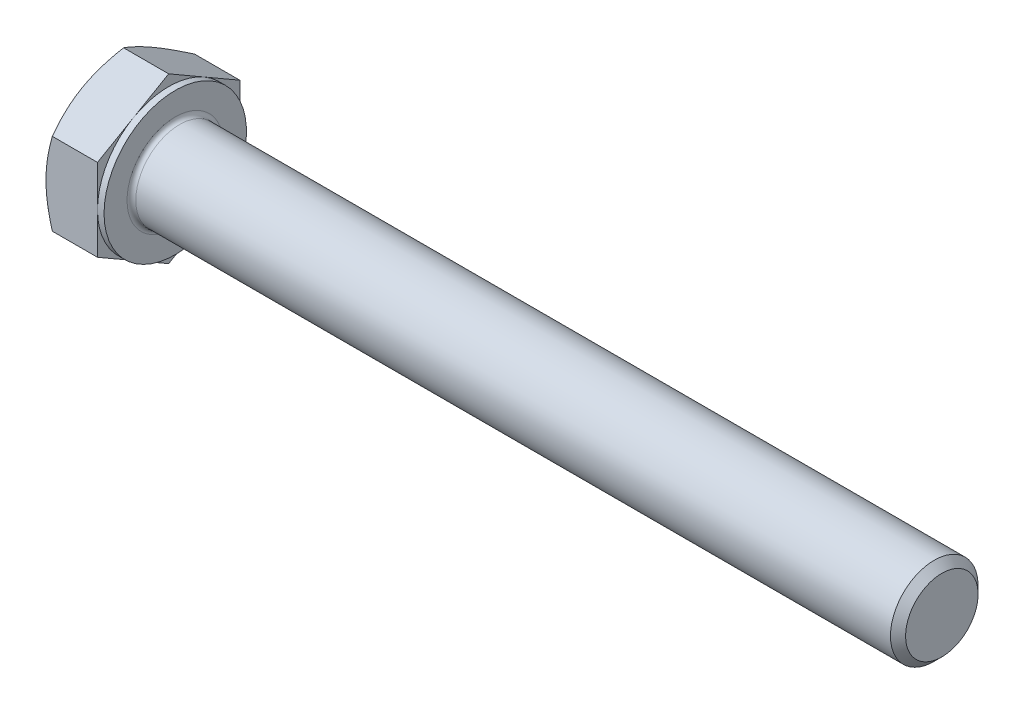
ISO-10303-21;
HEADER;
FILE_DESCRIPTION(('STEP AP214'),'2;1');
FILE_NAME('part.step','',(''),(''),'','','');
FILE_SCHEMA(('AUTOMOTIVE_DESIGN { 1 0 10303 214 1 1 1 1 }'));
ENDSEC;
DATA;
#1=APPLICATION_CONTEXT('core data for automotive mechanical design processes');
#2=APPLICATION_PROTOCOL_DEFINITION('international standard','automotive_design',2000,#1);
#3=PRODUCT_CONTEXT('',#1,'mechanical');
#4=PRODUCT('Part','Part','',(#3));
#5=PRODUCT_RELATED_PRODUCT_CATEGORY('part','',(#4));
#6=PRODUCT_DEFINITION_FORMATION('','',#4);
#7=PRODUCT_DEFINITION_CONTEXT('part definition',#1,'design');
#8=PRODUCT_DEFINITION('design','',#6,#7);
#9=PRODUCT_DEFINITION_SHAPE('','',#8);
#10=(LENGTH_UNIT() NAMED_UNIT(*) SI_UNIT(.MILLI.,.METRE.));
#11=(NAMED_UNIT(*) PLANE_ANGLE_UNIT() SI_UNIT($,.RADIAN.));
#12=(NAMED_UNIT(*) SI_UNIT($,.STERADIAN.) SOLID_ANGLE_UNIT());
#13=UNCERTAINTY_MEASURE_WITH_UNIT(LENGTH_MEASURE(1.E-05),#10,'distance_accuracy_value','');
#14=(GEOMETRIC_REPRESENTATION_CONTEXT(3) GLOBAL_UNCERTAINTY_ASSIGNED_CONTEXT((#13)) GLOBAL_UNIT_ASSIGNED_CONTEXT((#10,
#11,#12)) REPRESENTATION_CONTEXT('',''));
#15=CARTESIAN_POINT('',(0.,0.,0.));
#16=DIRECTION('',(0.,0.,1.));
#17=DIRECTION('',(1.,0.,0.));
#18=AXIS2_PLACEMENT_3D('',#15,#16,#17);
#19=CARTESIAN_POINT('',(0.,7.50555349946514,0.));
#20=DIRECTION('',(1.,0.,0.));
#21=DIRECTION('',(0.,0.,-1.));
#22=AXIS2_PLACEMENT_3D('',#19,#20,#21);
#23=PLANE('',#22);
#24=CARTESIAN_POINT('',(0.,0.,0.));
#25=DIRECTION('',(1.,0.,0.));
#26=DIRECTION('',(0.,0.,-1.));
#27=AXIS2_PLACEMENT_3D('',#24,#25,#26);
#28=CIRCLE('',#27,6.49999999995998);
#29=CARTESIAN_POINT('',(1.1554717790737E-11,-5.62916512458153,-3.24999999999));
#30=VERTEX_POINT('',#29);
#31=CARTESIAN_POINT('',(1.15520782680806E-11,0.,-6.49999999997999));
#32=VERTEX_POINT('',#31);
#33=EDGE_CURVE('E114',#30,#32,#28,.T.);
#34=ORIENTED_EDGE('',*,*,#33,.F.);
#35=CARTESIAN_POINT('',(0.,0.,0.));
#36=DIRECTION('',(1.,0.,0.));
#37=DIRECTION('',(0.,0.,-1.));
#38=AXIS2_PLACEMENT_3D('',#35,#36,#37);
#39=CIRCLE('',#38,6.49999999995998);
#40=CARTESIAN_POINT('',(1.15530521350374E-11,-5.62916512458151,3.24999999999001));
#41=VERTEX_POINT('',#40);
#42=EDGE_CURVE('E111',#41,#30,#39,.T.);
#43=ORIENTED_EDGE('',*,*,#42,.F.);
#44=CARTESIAN_POINT('',(0.,0.,0.));
#45=DIRECTION('',(1.,0.,0.));
#46=DIRECTION('',(0.,0.,-1.));
#47=AXIS2_PLACEMENT_3D('',#44,#45,#46);
#48=CIRCLE('',#47,6.49999999995998);
#49=CARTESIAN_POINT('',(1.15519427428088E-11,0.,6.49999999997999));
#50=VERTEX_POINT('',#49);
#51=EDGE_CURVE('E474',#50,#41,#48,.T.);
#52=ORIENTED_EDGE('',*,*,#51,.F.);
#53=CARTESIAN_POINT('',(0.,0.,0.));
#54=DIRECTION('',(1.,0.,0.));
#55=DIRECTION('',(0.,0.,-1.));
#56=AXIS2_PLACEMENT_3D('',#53,#54,#55);
#57=CIRCLE('',#56,6.49999999995998);
#58=CARTESIAN_POINT('',(1.15519072203646E-11,5.62916512458152,3.24999999999));
#59=VERTEX_POINT('',#58);
#60=EDGE_CURVE('E176',#59,#50,#57,.T.);
#61=ORIENTED_EDGE('',*,*,#60,.F.);
#62=CARTESIAN_POINT('',(0.,0.,0.));
#63=DIRECTION('',(1.,0.,0.));
#64=DIRECTION('',(0.,0.,-1.));
#65=AXIS2_PLACEMENT_3D('',#62,#63,#64);
#66=CIRCLE('',#65,6.49999999995998);
#67=CARTESIAN_POINT('',(1.15517194402141E-11,5.62916512458152,-3.24999999999));
#68=VERTEX_POINT('',#67);
#69=EDGE_CURVE('E472',#68,#59,#66,.T.);
#70=ORIENTED_EDGE('',*,*,#69,.F.);
#71=CARTESIAN_POINT('',(0.,0.,0.));
#72=DIRECTION('',(1.,0.,0.));
#73=DIRECTION('',(0.,0.,-1.));
#74=AXIS2_PLACEMENT_3D('',#71,#72,#73);
#75=CIRCLE('',#74,6.49999999995998);
#76=EDGE_CURVE('E117',#32,#68,#75,.T.);
#77=ORIENTED_EDGE('',*,*,#76,.F.);
#78=EDGE_LOOP('',(#34,#43,#52,#61,#70,#77));
#79=FACE_BOUND('',#78,.T.);
#80=ADVANCED_FACE('F17',(#79),#23,.F.);
#81=CARTESIAN_POINT('',(0.584039923126056,0.,0.));
#82=DIRECTION('',(1.,0.,0.));
#83=DIRECTION('',(0.,0.,-1.));
#84=AXIS2_PLACEMENT_3D('',#81,#82,#83);
#85=CONICAL_SURFACE('',#84,7.51158682049891,1.047197551212);
#86=ORIENTED_EDGE('',*,*,#42,.T.);
#87=CARTESIAN_POINT('',(2.38330535814892E-11,-5.62916512459777,-3.24999999999938));
#88=CARTESIAN_POINT('',(-2.65652344164261E-05,-5.70880728473447,-3.11205573221969));
#89=CARTESIAN_POINT('',(0.00337972763251715,-5.78844560823788,-2.97411810968284));
#90=CARTESIAN_POINT('',(0.0168605830573989,-5.94756588426562,-2.69851370708889));
#91=CARTESIAN_POINT('',(0.0269338255085056,-6.02704786462283,-2.56084687882384));
#92=CARTESIAN_POINT('',(0.0534848017009937,-6.18534206384372,-2.28667328322969));
#93=CARTESIAN_POINT('',(0.0699302938009773,-6.26415564509097,-2.15016415618305));
#94=CARTESIAN_POINT('',(0.108872020464248,-6.42140731241996,-1.87779627879436));
#95=CARTESIAN_POINT('',(0.131368414291867,-6.4998453885628,-1.74193754566698));
#96=CARTESIAN_POINT('',(0.207238975555897,-6.73427122699288,-1.33590008289914));
#97=CARTESIAN_POINT('',(0.269031363386546,-6.88957797343577,-1.06690090730184));
#98=CARTESIAN_POINT('',(0.4115404146045,-7.19885589650209,-0.531215830891611));
#99=CARTESIAN_POINT('',(0.49235158909237,-7.35281628523265,-0.264548615257222));
#100=CARTESIAN_POINT('',(0.580556583603043,-7.50555349946482,-5.67872870583599E-13));
#101=B_SPLINE_CURVE_WITH_KNOTS('',3,(#87,#88,#89,#90,#91,#92,#93,#94,#95,#96,#97,#98,#99,#100),
.UNSPECIFIED.,.F.,.F.,(4,2,2,2,2,2,4),(0.,0.47780419504982,0.955513809519797,1.43083727329602,
1.90617324917161,2.85559935540238,3.80984701130895),.UNSPECIFIED.);
#102=CARTESIAN_POINT('',(0.580556583603043,-7.50555349946482,0.));
#103=VERTEX_POINT('',#102);
#104=EDGE_CURVE('E129',#30,#103,#101,.T.);
#105=ORIENTED_EDGE('',*,*,#104,.T.);
#106=CARTESIAN_POINT('',(0.580556583603042,-7.50555349946482,5.69563900151584E-13));
#107=CARTESIAN_POINT('',(0.492351589092377,-7.35281628523265,0.264548615257212));
#108=CARTESIAN_POINT('',(0.411540414604506,-7.19885589650209,0.531215830891593));
#109=CARTESIAN_POINT('',(0.269031363386549,-6.88957797343579,1.06690090730181));
#110=CARTESIAN_POINT('',(0.207238975555897,-6.7342712269929,1.33590008289911));
#111=CARTESIAN_POINT('',(0.131368414291873,-6.49984538856282,1.74193754566694));
#112=CARTESIAN_POINT('',(0.108872020464258,-6.42140731241997,1.87779627879431));
#113=CARTESIAN_POINT('',(0.0699302938009776,-6.26415564509101,2.15016415618299));
#114=CARTESIAN_POINT('',(0.0534848017009802,-6.18534206384378,2.28667328322964));
#115=CARTESIAN_POINT('',(0.0269338255085282,-6.02704786462284,2.56084687882374));
#116=CARTESIAN_POINT('',(0.0168605830574716,-5.94756588426557,2.69851370708873));
#117=CARTESIAN_POINT('',(0.00337972763244808,-5.78844560823805,2.97411810968277));
#118=CARTESIAN_POINT('',(-2.65652346774801E-05,-5.70880728473494,3.11205573221977));
#119=CARTESIAN_POINT('',(2.31061042700748E-11,-5.62916512459895,3.24999999999984));
#120=B_SPLINE_CURVE_WITH_KNOTS('',3,(#106,#107,#108,#109,#110,#111,#112,#113,#114,#115,#116,
#117,#118,#119),.UNSPECIFIED.,.F.,.F.,(4,2,2,2,2,2,4),(0.,0.95424765590654,1.9036737621373,
2.37900973801287,2.85433320178907,3.33204281625901,3.80984701130877),.UNSPECIFIED.);
#121=EDGE_CURVE('E135',#103,#41,#120,.T.);
#122=ORIENTED_EDGE('',*,*,#121,.T.);
#123=EDGE_LOOP('',(#86,#105,#122));
#124=FACE_BOUND('',#123,.T.);
#125=ADVANCED_FACE('F133',(#124),#85,.T.);
#126=CARTESIAN_POINT('',(0.584039923126056,0.,0.));
#127=DIRECTION('',(1.,0.,0.));
#128=DIRECTION('',(0.,0.,-1.));
#129=AXIS2_PLACEMENT_3D('',#126,#127,#128);
#130=CONICAL_SURFACE('',#129,7.51158682049891,1.047197551212);
#131=ORIENTED_EDGE('',*,*,#33,.T.);
#132=CARTESIAN_POINT('',(2.38261934329666E-11,0.,-6.49999999999875));
#133=CARTESIAN_POINT('',(-2.65652344229879E-05,-0.159284320272008,-6.49999999999955));
#134=CARTESIAN_POINT('',(0.00337972763251106,-0.318560967278251,-6.49999999999988));
#135=CARTESIAN_POINT('',(0.0168605830573936,-0.636801519333315,-6.50000000000012));
#136=CARTESIAN_POINT('',(0.0269338255085006,-0.795765480047881,-6.50000000000003));
#137=CARTESIAN_POINT('',(0.0534848017009886,-1.11235387848978,-6.49999999999997));
#138=CARTESIAN_POINT('',(0.0699302938009718,-1.26998104098423,-6.49999999999999));
#139=CARTESIAN_POINT('',(0.108872020464242,-1.58448437564218,-6.50000000000001));
#140=CARTESIAN_POINT('',(0.131368414291862,-1.74136052792788,-6.5));
#141=CARTESIAN_POINT('',(0.207238975555892,-2.21021220478805,-6.49999999999999));
#142=CARTESIAN_POINT('',(0.269031363386541,-2.52082569767383,-6.5));
#143=CARTESIAN_POINT('',(0.411540414604495,-3.13938154380645,-6.5));
#144=CARTESIAN_POINT('',(0.492351589092366,-3.44730232126758,-6.50000000000001));
#145=CARTESIAN_POINT('',(0.580556583603039,-3.75277674973192,-6.5));
#146=B_SPLINE_CURVE_WITH_KNOTS('',3,(#132,#133,#134,#135,#136,#137,#138,#139,#140,#141,#142,
#143,#144,#145),.UNSPECIFIED.,.F.,.F.,(4,2,2,2,2,2,4),(0.,0.477804195049821,0.955513809519796,
1.43083727329602,1.90617324917161,2.85559935540238,3.80984701130895),.UNSPECIFIED.);
#147=CARTESIAN_POINT('',(0.580556583603039,-3.75277674973241,-6.49999999999972));
#148=VERTEX_POINT('',#147);
#149=EDGE_CURVE('E125',#32,#148,#146,.T.);
#150=ORIENTED_EDGE('',*,*,#149,.T.);
#151=CARTESIAN_POINT('',(0.580556583603039,-3.7527767497329,-6.49999999999943));
#152=CARTESIAN_POINT('',(0.492351589092374,-3.90551396396507,-6.23545138474279));
#153=CARTESIAN_POINT('',(0.411540414604505,-4.05947435269563,-5.96878416910841));
#154=CARTESIAN_POINT('',(0.26903136338655,-4.36875227576193,-5.4330990926982));
#155=CARTESIAN_POINT('',(0.207238975555899,-4.52405902220482,-5.1640999171009));
#156=CARTESIAN_POINT('',(0.131368414291876,-4.7584848606349,-4.75806245433307));
#157=CARTESIAN_POINT('',(0.108872020464261,-4.83692293677774,-4.62220372120571));
#158=CARTESIAN_POINT('',(0.0699302938009808,-4.9941746041067,-4.34983584381702));
#159=CARTESIAN_POINT('',(0.0534848017009837,-5.07298818535393,-4.21332671677038));
#160=CARTESIAN_POINT('',(0.0269338255085323,-5.23128238457486,-3.93915312117628));
#161=CARTESIAN_POINT('',(0.016860583057476,-5.31076436493214,-3.80148629291129));
#162=CARTESIAN_POINT('',(0.00337972763245258,-5.46988464095965,-3.52588189031725));
#163=CARTESIAN_POINT('',(-2.65652346731176E-05,-5.54952296446276,-3.38794426778026));
#164=CARTESIAN_POINT('',(2.31099363530069E-11,-5.62916512459875,-3.25000000000019));
#165=B_SPLINE_CURVE_WITH_KNOTS('',3,(#151,#152,#153,#154,#155,#156,#157,#158,#159,#160,#161,
#162,#163,#164),.UNSPECIFIED.,.F.,.F.,(4,2,2,2,2,2,4),(0.,0.954247655906531,1.90367376213729,
2.37900973801285,2.85433320178905,3.33204281625898,3.80984701130874),.UNSPECIFIED.);
#166=EDGE_CURVE('E123',#148,#30,#165,.T.);
#167=ORIENTED_EDGE('',*,*,#166,.T.);
#168=EDGE_LOOP('',(#131,#150,#167));
#169=FACE_BOUND('',#168,.T.);
#170=ADVANCED_FACE('F124',(#169),#130,.T.);
#171=CARTESIAN_POINT('',(0.584039923126056,0.,0.));
#172=DIRECTION('',(1.,0.,0.));
#173=DIRECTION('',(0.,0.,-1.));
#174=AXIS2_PLACEMENT_3D('',#171,#172,#173);
#175=CONICAL_SURFACE('',#174,7.51158682049891,1.047197551212);
#176=CARTESIAN_POINT('',(0.580556583603033,3.7527767497319,-6.5));
#177=CARTESIAN_POINT('',(0.492351589092368,3.44730232126758,-6.5));
#178=CARTESIAN_POINT('',(0.411540414604499,3.13938154380646,-6.5));
#179=CARTESIAN_POINT('',(0.269031363386544,2.52082569767386,-6.5));
#180=CARTESIAN_POINT('',(0.207238975555893,2.21021220478808,-6.5));
#181=CARTESIAN_POINT('',(0.13136841429187,1.74136052792792,-6.5));
#182=CARTESIAN_POINT('',(0.108872020464255,1.58448437564224,-6.5));
#183=CARTESIAN_POINT('',(0.0699302938009747,1.26998104098431,-6.5));
#184=CARTESIAN_POINT('',(0.0534848017009776,1.11235387848986,-6.5));
#185=CARTESIAN_POINT('',(0.0269338255085264,0.795765480047986,-6.5));
#186=CARTESIAN_POINT('',(0.0168605830574702,0.636801519333434,-6.5));
#187=CARTESIAN_POINT('',(0.00337972763244701,0.318560967278407,-6.5));
#188=CARTESIAN_POINT('',(-2.65652346786734E-05,0.159284320272187,-6.5));
#189=CARTESIAN_POINT('',(2.31041565361612E-11,2.07888749653668E-13,-6.5));
#190=B_SPLINE_CURVE_WITH_KNOTS('',3,(#176,#177,#178,#179,#180,#181,#182,#183,#184,#185,#186,
#187,#188,#189),.UNSPECIFIED.,.F.,.F.,(4,2,2,2,2,2,4),(0.,0.954247655906532,1.90367376213729,
2.37900973801285,2.85433320178905,3.33204281625898,3.80984701130874),.UNSPECIFIED.);
#191=CARTESIAN_POINT('',(0.580556583603033,3.7527767497324,-6.49999999999971));
#192=VERTEX_POINT('',#191);
#193=EDGE_CURVE('E143',#192,#32,#190,.T.);
#194=ORIENTED_EDGE('',*,*,#193,.T.);
#195=ORIENTED_EDGE('',*,*,#76,.T.);
#196=CARTESIAN_POINT('',(2.38258913852585E-11,5.62916512459776,-3.24999999999938));
#197=CARTESIAN_POINT('',(-2.65652344229074E-05,5.54952296446245,-3.38794426777988));
#198=CARTESIAN_POINT('',(0.00337972763251109,5.46988464095962,-3.52588189031705));
#199=CARTESIAN_POINT('',(0.0168605830573933,5.31076436493229,-3.80148629291124));
#200=CARTESIAN_POINT('',(0.0269338255084999,5.23128238457493,-3.9391531211762));
#201=CARTESIAN_POINT('',(0.0534848017009876,5.07298818535393,-4.21332671677028));
#202=CARTESIAN_POINT('',(0.0699302938009709,4.99417460410672,-4.34983584381695));
#203=CARTESIAN_POINT('',(0.108872020464241,4.83692293677777,-4.62220372120566));
#204=CARTESIAN_POINT('',(0.13136841429186,4.75848486063491,-4.75806245433303));
#205=CARTESIAN_POINT('',(0.207238975555889,4.52405902220482,-5.16409991710086));
#206=CARTESIAN_POINT('',(0.269031363386538,4.36875227576193,-5.43309909269816));
#207=CARTESIAN_POINT('',(0.411540414604492,4.05947435269562,-5.96878416910839));
#208=CARTESIAN_POINT('',(0.492351589092362,3.90551396396506,-6.23545138474278));
#209=CARTESIAN_POINT('',(0.580556583603033,3.75277674973289,-6.49999999999943));
#210=B_SPLINE_CURVE_WITH_KNOTS('',3,(#196,#197,#198,#199,#200,#201,#202,#203,#204,#205,#206,
#207,#208,#209),.UNSPECIFIED.,.F.,.F.,(4,2,2,2,2,2,4),(0.,0.477804195049819,0.955513809519792,
1.43083727329602,1.90617324917161,2.85559935540237,3.80984701130894),.UNSPECIFIED.);
#211=EDGE_CURVE('E259',#68,#192,#210,.T.);
#212=ORIENTED_EDGE('',*,*,#211,.T.);
#213=EDGE_LOOP('',(#194,#195,#212));
#214=FACE_BOUND('',#213,.T.);
#215=ADVANCED_FACE('F248',(#214),#175,.T.);
#216=CARTESIAN_POINT('',(0.584039923126056,0.,0.));
#217=DIRECTION('',(1.,0.,0.));
#218=DIRECTION('',(0.,0.,-1.));
#219=AXIS2_PLACEMENT_3D('',#216,#217,#218);
#220=CONICAL_SURFACE('',#219,7.51158682049891,1.047197551212);
#221=CARTESIAN_POINT('',(0.580556583603038,7.50555349946481,-5.68103519030132E-13));
#222=CARTESIAN_POINT('',(0.492351589092373,7.35281628523265,-0.264548615257209));
#223=CARTESIAN_POINT('',(0.411540414604503,7.19885589650209,-0.53121583089159));
#224=CARTESIAN_POINT('',(0.269031363386547,6.88957797343579,-1.06690090730181));
#225=CARTESIAN_POINT('',(0.207238975555896,6.7342712269929,-1.33590008289911));
#226=CARTESIAN_POINT('',(0.131368414291872,6.49984538856282,-1.74193754566694));
#227=CARTESIAN_POINT('',(0.108872020464256,6.42140731241997,-1.8777962787943));
#228=CARTESIAN_POINT('',(0.0699302938009756,6.264155645091,-2.15016415618298));
#229=CARTESIAN_POINT('',(0.0534848017009786,6.18534206384378,-2.28667328322963));
#230=CARTESIAN_POINT('',(0.0269338255085268,6.02704786462284,-2.56084687882373));
#231=CARTESIAN_POINT('',(0.0168605830574699,5.94756588426557,-2.69851370708872));
#232=CARTESIAN_POINT('',(0.00337972763244571,5.78844560823805,-2.97411810968276));
#233=CARTESIAN_POINT('',(-2.65652346801977E-05,5.70880728473494,-3.11205573221975));
#234=CARTESIAN_POINT('',(2.31033136875451E-11,5.62916512459895,-3.24999999999983));
#235=B_SPLINE_CURVE_WITH_KNOTS('',3,(#221,#222,#223,#224,#225,#226,#227,#228,#229,#230,#231,
#232,#233,#234),.UNSPECIFIED.,.F.,.F.,(4,2,2,2,2,2,4),(0.,0.954247655906536,1.9036737621373,
2.37900973801286,2.85433320178906,3.332042816259,3.80984701130876),.UNSPECIFIED.);
#236=CARTESIAN_POINT('',(0.580556583603038,7.50555349946481,0.));
#237=VERTEX_POINT('',#236);
#238=EDGE_CURVE('E253',#237,#68,#235,.T.);
#239=ORIENTED_EDGE('',*,*,#238,.T.);
#240=ORIENTED_EDGE('',*,*,#69,.T.);
#241=CARTESIAN_POINT('',(2.38253425428388E-11,5.62916512459776,3.24999999999938));
#242=CARTESIAN_POINT('',(-2.65652344235492E-05,5.70880728473446,3.11205573221969));
#243=CARTESIAN_POINT('',(0.0033797276325105,5.78844560823787,2.97411810968284));
#244=CARTESIAN_POINT('',(0.0168605830573929,5.94756588426561,2.69851370708889));
#245=CARTESIAN_POINT('',(0.0269338255084998,6.02704786462281,2.56084687882384));
#246=CARTESIAN_POINT('',(0.0534848017009879,6.18534206384371,2.28667328322969));
#247=CARTESIAN_POINT('',(0.0699302938009714,6.26415564509096,2.15016415618305));
#248=CARTESIAN_POINT('',(0.108872020464241,6.42140731241994,1.87779627879436));
#249=CARTESIAN_POINT('',(0.131368414291861,6.49984538856279,1.74193754566699));
#250=CARTESIAN_POINT('',(0.207238975555891,6.73427122699287,1.33590008289914));
#251=CARTESIAN_POINT('',(0.26903136338654,6.88957797343576,1.06690090730184));
#252=CARTESIAN_POINT('',(0.411540414604496,7.19885589650208,0.531215830891612));
#253=CARTESIAN_POINT('',(0.492351589092367,7.35281628523265,0.264548615257222));
#254=CARTESIAN_POINT('',(0.580556583603038,7.50555349946481,5.68031516550249E-13));
#255=B_SPLINE_CURVE_WITH_KNOTS('',3,(#241,#242,#243,#244,#245,#246,#247,#248,#249,#250,#251,
#252,#253,#254),.UNSPECIFIED.,.F.,.F.,(4,2,2,2,2,2,4),(0.,0.477804195049821,0.955513809519796,
1.43083727329602,1.90617324917161,2.85559935540238,3.80984701130896),.UNSPECIFIED.);
#256=EDGE_CURVE('E239',#59,#237,#255,.T.);
#257=ORIENTED_EDGE('',*,*,#256,.T.);
#258=EDGE_LOOP('',(#239,#240,#257));
#259=FACE_BOUND('',#258,.T.);
#260=ADVANCED_FACE('F245',(#259),#220,.T.);
#261=CARTESIAN_POINT('',(0.584039923126056,0.,0.));
#262=DIRECTION('',(1.,0.,0.));
#263=DIRECTION('',(0.,0.,-1.));
#264=AXIS2_PLACEMENT_3D('',#261,#262,#263);
#265=CONICAL_SURFACE('',#264,7.51158682049891,1.047197551212);
#266=ORIENTED_EDGE('',*,*,#51,.T.);
#267=CARTESIAN_POINT('',(2.38287847450159E-11,-5.62916512459776,3.24999999999939));
#268=CARTESIAN_POINT('',(-2.65652344207412E-05,-5.54952296446245,3.38794426777989));
#269=CARTESIAN_POINT('',(0.00337972763251307,-5.46988464095961,3.52588189031706));
#270=CARTESIAN_POINT('',(0.0168605830573953,-5.31076436493229,3.80148629291125));
#271=CARTESIAN_POINT('',(0.0269338255085021,-5.23128238457493,3.93915312117621));
#272=CARTESIAN_POINT('',(0.0534848017009898,-5.07298818535393,4.21332671677029));
#273=CARTESIAN_POINT('',(0.0699302938009729,-4.99417460410672,4.34983584381696));
#274=CARTESIAN_POINT('',(0.108872020464243,-4.83692293677776,4.62220372120566));
#275=CARTESIAN_POINT('',(0.131368414291862,-4.75848486063491,4.75806245433303));
#276=CARTESIAN_POINT('',(0.207238975555892,-4.52405902220482,5.16409991710086));
#277=CARTESIAN_POINT('',(0.26903136338654,-4.36875227576193,5.43309909269817));
#278=CARTESIAN_POINT('',(0.411540414604493,-4.05947435269562,5.9687841691084));
#279=CARTESIAN_POINT('',(0.492351589092362,-3.90551396396506,6.23545138474279));
#280=CARTESIAN_POINT('',(0.580556583603034,-3.75277674973289,6.49999999999943));
#281=B_SPLINE_CURVE_WITH_KNOTS('',3,(#267,#268,#269,#270,#271,#272,#273,#274,#275,#276,#277,
#278,#279,#280),.UNSPECIFIED.,.F.,.F.,(4,2,2,2,2,2,4),(0.,0.477804195049818,0.95551380951979,
1.43083727329601,1.9061732491716,2.85559935540236,3.80984701130893),.UNSPECIFIED.);
#282=CARTESIAN_POINT('',(0.580556583603129,-3.75277674973272,6.49999999999972));
#283=VERTEX_POINT('',#282);
#284=EDGE_CURVE('E130',#41,#283,#281,.T.);
#285=ORIENTED_EDGE('',*,*,#284,.T.);
#286=CARTESIAN_POINT('',(0.580556583603033,-3.7527767497319,6.5));
#287=CARTESIAN_POINT('',(0.492351589092369,-3.44730232126758,6.5));
#288=CARTESIAN_POINT('',(0.411540414604499,-3.13938154380646,6.5));
#289=CARTESIAN_POINT('',(0.269031363386544,-2.52082569767386,6.5));
#290=CARTESIAN_POINT('',(0.207238975555893,-2.21021220478808,6.5));
#291=CARTESIAN_POINT('',(0.131368414291871,-1.74136052792792,6.5));
#292=CARTESIAN_POINT('',(0.108872020464255,-1.58448437564223,6.5));
#293=CARTESIAN_POINT('',(0.0699302938009752,-1.26998104098431,6.5));
#294=CARTESIAN_POINT('',(0.0534848017009778,-1.11235387848986,6.5));
#295=CARTESIAN_POINT('',(0.0269338255085262,-0.795765480047986,6.5));
#296=CARTESIAN_POINT('',(0.0168605830574699,-0.636801519333434,6.5));
#297=CARTESIAN_POINT('',(0.00337972763244669,-0.318560967278406,6.5));
#298=CARTESIAN_POINT('',(-2.65652346789591E-05,-0.159284320272187,6.5));
#299=CARTESIAN_POINT('',(2.31038854856177E-11,-2.07400805736288E-13,6.5));
#300=B_SPLINE_CURVE_WITH_KNOTS('',3,(#286,#287,#288,#289,#290,#291,#292,#293,#294,#295,#296,
#297,#298,#299),.UNSPECIFIED.,.F.,.F.,(4,2,2,2,2,2,4),(0.,0.954247655906532,1.90367376213729,
2.37900973801285,2.85433320178905,3.33204281625898,3.80984701130874),.UNSPECIFIED.);
#301=EDGE_CURVE('E216',#283,#50,#300,.T.);
#302=ORIENTED_EDGE('',*,*,#301,.T.);
#303=EDGE_LOOP('',(#266,#285,#302));
#304=FACE_BOUND('',#303,.T.);
#305=ADVANCED_FACE('F192',(#304),#265,.T.);
#306=CARTESIAN_POINT('',(0.584039923126056,0.,0.));
#307=DIRECTION('',(1.,0.,0.));
#308=DIRECTION('',(0.,0.,-1.));
#309=AXIS2_PLACEMENT_3D('',#306,#307,#308);
#310=CONICAL_SURFACE('',#309,7.51158682049891,1.047197551212);
#311=CARTESIAN_POINT('',(0.580556583603033,3.75277674973289,6.49999999999943));
#312=CARTESIAN_POINT('',(0.492351589092368,3.90551396396505,6.23545138474279));
#313=CARTESIAN_POINT('',(0.411540414604499,4.05947435269561,5.96878416910841));
#314=CARTESIAN_POINT('',(0.269031363386545,4.36875227576191,5.4330990926982));
#315=CARTESIAN_POINT('',(0.207238975555894,4.5240590222048,5.1640999171009));
#316=CARTESIAN_POINT('',(0.13136841429187,4.75848486063488,4.75806245433307));
#317=CARTESIAN_POINT('',(0.108872020464254,4.83692293677772,4.62220372120571));
#318=CARTESIAN_POINT('',(0.0699302938009745,4.99417460410669,4.34983584381702));
#319=CARTESIAN_POINT('',(0.0534848017009776,5.07298818535391,4.21332671677038));
#320=CARTESIAN_POINT('',(0.0269338255085262,5.23128238457485,3.93915312117628));
#321=CARTESIAN_POINT('',(0.0168605830574696,5.31076436493213,3.80148629291129));
#322=CARTESIAN_POINT('',(0.00337972763244603,5.46988464095964,3.52588189031725));
#323=CARTESIAN_POINT('',(-2.65652346796775E-05,5.54952296446275,3.38794426778026));
#324=CARTESIAN_POINT('',(2.31038144407292E-11,5.62916512459874,3.25000000000019));
#325=B_SPLINE_CURVE_WITH_KNOTS('',3,(#311,#312,#313,#314,#315,#316,#317,#318,#319,#320,#321,
#322,#323,#324),.UNSPECIFIED.,.F.,.F.,(4,2,2,2,2,2,4),(0.,0.954247655906531,1.90367376213729,
2.37900973801285,2.85433320178905,3.33204281625898,3.80984701130874),.UNSPECIFIED.);
#326=CARTESIAN_POINT('',(0.580556583603033,3.7527767497324,6.49999999999971));
#327=VERTEX_POINT('',#326);
#328=EDGE_CURVE('E198',#327,#59,#325,.T.);
#329=ORIENTED_EDGE('',*,*,#328,.T.);
#330=ORIENTED_EDGE('',*,*,#60,.T.);
#331=CARTESIAN_POINT('',(2.38258178543169E-11,0.,6.49999999999875));
#332=CARTESIAN_POINT('',(-2.65652344228372E-05,0.159284320272009,6.49999999999955));
#333=CARTESIAN_POINT('',(0.0033797276325111,0.318560967278251,6.49999999999988));
#334=CARTESIAN_POINT('',(0.0168605830573931,0.636801519333313,6.50000000000012));
#335=CARTESIAN_POINT('',(0.0269338255084996,0.795765480047878,6.50000000000003));
#336=CARTESIAN_POINT('',(0.0534848017009874,1.11235387848977,6.49999999999997));
#337=CARTESIAN_POINT('',(0.0699302938009709,1.26998104098423,6.49999999999999));
#338=CARTESIAN_POINT('',(0.108872020464241,1.58448437564217,6.50000000000001));
#339=CARTESIAN_POINT('',(0.13136841429186,1.74136052792787,6.5));
#340=CARTESIAN_POINT('',(0.20723897555589,2.21021220478804,6.49999999999999));
#341=CARTESIAN_POINT('',(0.269031363386538,2.52082569767382,6.5));
#342=CARTESIAN_POINT('',(0.411540414604492,3.13938154380644,6.5));
#343=CARTESIAN_POINT('',(0.492351589092362,3.44730232126756,6.50000000000001));
#344=CARTESIAN_POINT('',(0.580556583603033,3.7527767497319,6.5));
#345=B_SPLINE_CURVE_WITH_KNOTS('',3,(#331,#332,#333,#334,#335,#336,#337,#338,#339,#340,#341,
#342,#343,#344),.UNSPECIFIED.,.F.,.F.,(4,2,2,2,2,2,4),(0.,0.477804195049818,0.955513809519792,
1.43083727329602,1.9061732491716,2.85559935540237,3.80984701130894),.UNSPECIFIED.);
#346=EDGE_CURVE('E207',#50,#327,#345,.T.);
#347=ORIENTED_EDGE('',*,*,#346,.T.);
#348=EDGE_LOOP('',(#329,#330,#347));
#349=FACE_BOUND('',#348,.T.);
#350=ADVANCED_FACE('F187',(#349),#310,.T.);
#351=CARTESIAN_POINT('',(5.3,-7.50555349946515,0.));
#352=DIRECTION('',(0.,0.866025403784438,-0.500000000000002));
#353=DIRECTION('',(0.,0.500000000000002,0.866025403784438));
#354=AXIS2_PLACEMENT_3D('',#351,#352,#353);
#355=PLANE('',#354);
#356=DIRECTION('',(1.,0.,0.));
#357=VECTOR('',#356,1.);
#358=CARTESIAN_POINT('',(5.3,-3.75277674973256,6.5));
#359=LINE('',#358,#357);
#360=CARTESIAN_POINT('',(4.7,-3.75277674973256,6.5));
#361=VERTEX_POINT('',#360);
#362=EDGE_CURVE('E398',#361,#283,#359,.F.);
#363=ORIENTED_EDGE('',*,*,#362,.T.);
#364=ORIENTED_EDGE('',*,*,#284,.F.);
#365=ORIENTED_EDGE('',*,*,#121,.F.);
#366=DIRECTION('',(1.,0.,0.));
#367=VECTOR('',#366,1.);
#368=CARTESIAN_POINT('',(5.3,-7.50555349946515,0.));
#369=LINE('',#368,#367);
#370=CARTESIAN_POINT('',(4.7,-7.50555349946515,0.));
#371=VERTEX_POINT('',#370);
#372=EDGE_CURVE('E141',#103,#371,#369,.T.);
#373=ORIENTED_EDGE('',*,*,#372,.T.);
#374=DIRECTION('',(0.,-0.500000000000003,-0.866025403784437));
#375=VECTOR('',#374,1.);
#376=CARTESIAN_POINT('',(4.7,-5.62916512459884,3.25000000000001));
#377=LINE('',#376,#375);
#378=CARTESIAN_POINT('',(4.7,-5.62916512459884,3.25000000000001));
#379=VERTEX_POINT('',#378);
#380=EDGE_CURVE('E378',#379,#371,#377,.T.);
#381=ORIENTED_EDGE('',*,*,#380,.F.);
#382=DIRECTION('',(0.,-0.500000000000001,-0.866025403784438));
#383=VECTOR('',#382,1.);
#384=CARTESIAN_POINT('',(4.7,-3.75277674973256,6.5));
#385=LINE('',#384,#383);
#386=EDGE_CURVE('E383',#361,#379,#385,.T.);
#387=ORIENTED_EDGE('',*,*,#386,.F.);
#388=EDGE_LOOP('',(#363,#364,#365,#373,#381,#387));
#389=FACE_BOUND('',#388,.T.);
#390=ADVANCED_FACE('F183',(#389),#355,.F.);
#391=CARTESIAN_POINT('',(5.3,-3.75277674973258,-6.5));
#392=DIRECTION('',(0.,0.866025403784439,0.5));
#393=DIRECTION('',(0.,-0.5,0.866025403784439));
#394=AXIS2_PLACEMENT_3D('',#391,#392,#393);
#395=PLANE('',#394);
#396=ORIENTED_EDGE('',*,*,#372,.F.);
#397=ORIENTED_EDGE('',*,*,#104,.F.);
#398=ORIENTED_EDGE('',*,*,#166,.F.);
#399=DIRECTION('',(1.,0.,0.));
#400=VECTOR('',#399,1.);
#401=CARTESIAN_POINT('',(5.3,-3.75277674973258,-6.5));
#402=LINE('',#401,#400);
#403=CARTESIAN_POINT('',(4.7,-3.75277674973258,-6.5));
#404=VERTEX_POINT('',#403);
#405=EDGE_CURVE('E260',#148,#404,#402,.T.);
#406=ORIENTED_EDGE('',*,*,#405,.T.);
#407=DIRECTION('',(0.,0.499999999999998,-0.86602540378444));
#408=VECTOR('',#407,1.);
#409=CARTESIAN_POINT('',(4.7,-5.62916512459885,-3.25));
#410=LINE('',#409,#408);
#411=CARTESIAN_POINT('',(4.7,-5.62916512459885,-3.25));
#412=VERTEX_POINT('',#411);
#413=EDGE_CURVE('E368',#412,#404,#410,.T.);
#414=ORIENTED_EDGE('',*,*,#413,.F.);
#415=DIRECTION('',(0.,0.500000000000003,-0.866025403784437));
#416=VECTOR('',#415,1.);
#417=CARTESIAN_POINT('',(4.7,-7.50555349946515,0.));
#418=LINE('',#417,#416);
#419=EDGE_CURVE('E373',#371,#412,#418,.T.);
#420=ORIENTED_EDGE('',*,*,#419,.F.);
#421=EDGE_LOOP('',(#396,#397,#398,#406,#414,#420));
#422=FACE_BOUND('',#421,.T.);
#423=ADVANCED_FACE('F139',(#422),#395,.F.);
#424=CARTESIAN_POINT('',(5.3,3.75277674973256,-6.5));
#425=DIRECTION('',(0.,0.,1.));
#426=DIRECTION('',(0.,-1.,0.));
#427=AXIS2_PLACEMENT_3D('',#424,#425,#426);
#428=PLANE('',#427);
#429=ORIENTED_EDGE('',*,*,#405,.F.);
#430=ORIENTED_EDGE('',*,*,#149,.F.);
#431=ORIENTED_EDGE('',*,*,#193,.F.);
#432=DIRECTION('',(1.,0.,0.));
#433=VECTOR('',#432,1.);
#434=CARTESIAN_POINT('',(5.3,3.75277674973256,-6.5));
#435=LINE('',#434,#433);
#436=CARTESIAN_POINT('',(4.7,3.75277674973256,-6.5));
#437=VERTEX_POINT('',#436);
#438=EDGE_CURVE('E406',#192,#437,#435,.T.);
#439=ORIENTED_EDGE('',*,*,#438,.T.);
#440=DIRECTION('',(0.,1.,0.));
#441=VECTOR('',#440,1.);
#442=CARTESIAN_POINT('',(4.7,6.5,-6.5));
#443=LINE('',#442,#441);
#444=CARTESIAN_POINT('',(4.7,0.,-6.5));
#445=VERTEX_POINT('',#444);
#446=EDGE_CURVE('E353',#445,#437,#443,.T.);
#447=ORIENTED_EDGE('',*,*,#446,.F.);
#448=DIRECTION('',(0.,1.,0.));
#449=VECTOR('',#448,1.);
#450=CARTESIAN_POINT('',(4.7,6.5,-6.5));
#451=LINE('',#450,#449);
#452=EDGE_CURVE('E363',#404,#445,#451,.T.);
#453=ORIENTED_EDGE('',*,*,#452,.F.);
#454=EDGE_LOOP('',(#429,#430,#431,#439,#447,#453));
#455=FACE_BOUND('',#454,.T.);
#456=ADVANCED_FACE('F269',(#455),#428,.F.);
#457=CARTESIAN_POINT('',(5.3,3.75277674973256,-6.5));
#458=DIRECTION('',(0.,-0.866025403784438,0.500000000000001));
#459=DIRECTION('',(0.,-0.500000000000001,-0.866025403784438));
#460=AXIS2_PLACEMENT_3D('',#457,#458,#459);
#461=PLANE('',#460);
#462=ORIENTED_EDGE('',*,*,#438,.F.);
#463=ORIENTED_EDGE('',*,*,#211,.F.);
#464=ORIENTED_EDGE('',*,*,#238,.F.);
#465=DIRECTION('',(1.,0.,0.));
#466=VECTOR('',#465,1.);
#467=CARTESIAN_POINT('',(5.3,7.50555349946514,0.));
#468=LINE('',#467,#466);
#469=CARTESIAN_POINT('',(4.7,7.50555349946514,0.));
#470=VERTEX_POINT('',#469);
#471=EDGE_CURVE('E244',#237,#470,#468,.T.);
#472=ORIENTED_EDGE('',*,*,#471,.T.);
#473=DIRECTION('',(0.,0.500000000000001,0.866025403784438));
#474=VECTOR('',#473,1.);
#475=CARTESIAN_POINT('',(4.7,5.62916512459885,-3.25000000000001));
#476=LINE('',#475,#474);
#477=CARTESIAN_POINT('',(4.7,5.62916512459885,-3.25000000000001));
#478=VERTEX_POINT('',#477);
#479=EDGE_CURVE('E348',#478,#470,#476,.T.);
#480=ORIENTED_EDGE('',*,*,#479,.F.);
#481=DIRECTION('',(0.,0.500000000000001,0.866025403784438));
#482=VECTOR('',#481,1.);
#483=CARTESIAN_POINT('',(4.7,3.75277674973256,-6.5));
#484=LINE('',#483,#482);
#485=EDGE_CURVE('E358',#437,#478,#484,.T.);
#486=ORIENTED_EDGE('',*,*,#485,.F.);
#487=EDGE_LOOP('',(#462,#463,#464,#472,#480,#486));
#488=FACE_BOUND('',#487,.T.);
#489=ADVANCED_FACE('F235',(#488),#461,.F.);
#490=CARTESIAN_POINT('',(5.3,7.50555349946514,0.));
#491=DIRECTION('',(0.,-0.866025403784438,-0.500000000000001));
#492=DIRECTION('',(0.,0.500000000000001,-0.866025403784438));
#493=AXIS2_PLACEMENT_3D('',#490,#491,#492);
#494=PLANE('',#493);
#495=ORIENTED_EDGE('',*,*,#471,.F.);
#496=ORIENTED_EDGE('',*,*,#256,.F.);
#497=ORIENTED_EDGE('',*,*,#328,.F.);
#498=DIRECTION('',(1.,0.,0.));
#499=VECTOR('',#498,1.);
#500=CARTESIAN_POINT('',(5.3,3.75277674973256,6.5));
#501=LINE('',#500,#499);
#502=CARTESIAN_POINT('',(4.7,3.75277674973256,6.5));
#503=VERTEX_POINT('',#502);
#504=EDGE_CURVE('E215',#327,#503,#501,.T.);
#505=ORIENTED_EDGE('',*,*,#504,.T.);
#506=DIRECTION('',(0.,-0.500000000000001,0.866025403784438));
#507=VECTOR('',#506,1.);
#508=CARTESIAN_POINT('',(4.7,5.62916512459885,3.25000000000001));
#509=LINE('',#508,#507);
#510=CARTESIAN_POINT('',(4.7,5.62916512459885,3.25000000000001));
#511=VERTEX_POINT('',#510);
#512=EDGE_CURVE('E338',#511,#503,#509,.T.);
#513=ORIENTED_EDGE('',*,*,#512,.F.);
#514=DIRECTION('',(0.,-0.500000000000001,0.866025403784438));
#515=VECTOR('',#514,1.);
#516=CARTESIAN_POINT('',(4.7,7.50555349946514,0.));
#517=LINE('',#516,#515);
#518=EDGE_CURVE('E343',#470,#511,#517,.T.);
#519=ORIENTED_EDGE('',*,*,#518,.F.);
#520=EDGE_LOOP('',(#495,#496,#497,#505,#513,#519));
#521=FACE_BOUND('',#520,.T.);
#522=ADVANCED_FACE('F228',(#521),#494,.F.);
#523=CARTESIAN_POINT('',(5.3,3.75277674973256,6.5));
#524=DIRECTION('',(0.,0.,-1.));
#525=DIRECTION('',(0.,1.,0.));
#526=AXIS2_PLACEMENT_3D('',#523,#524,#525);
#527=PLANE('',#526);
#528=ORIENTED_EDGE('',*,*,#504,.F.);
#529=ORIENTED_EDGE('',*,*,#346,.F.);
#530=ORIENTED_EDGE('',*,*,#301,.F.);
#531=ORIENTED_EDGE('',*,*,#362,.F.);
#532=DIRECTION('',(0.,1.,0.));
#533=VECTOR('',#532,1.);
#534=CARTESIAN_POINT('',(4.7,6.5,6.5));
#535=LINE('',#534,#533);
#536=CARTESIAN_POINT('',(4.7,0.,6.5));
#537=VERTEX_POINT('',#536);
#538=EDGE_CURVE('E388',#537,#361,#535,.F.);
#539=ORIENTED_EDGE('',*,*,#538,.F.);
#540=DIRECTION('',(0.,1.,0.));
#541=VECTOR('',#540,1.);
#542=CARTESIAN_POINT('',(4.7,6.5,6.5));
#543=LINE('',#542,#541);
#544=EDGE_CURVE('E330',#503,#537,#543,.F.);
#545=ORIENTED_EDGE('',*,*,#544,.F.);
#546=EDGE_LOOP('',(#528,#529,#530,#531,#539,#545));
#547=FACE_BOUND('',#546,.T.);
#548=ADVANCED_FACE('F223',(#547),#527,.F.);
#549=CARTESIAN_POINT('',(4.7,6.5,0.));
#550=DIRECTION('',(1.,0.,0.));
#551=DIRECTION('',(0.,0.,-1.));
#552=AXIS2_PLACEMENT_3D('',#549,#550,#551);
#553=PLANE('',#552);
#554=ORIENTED_EDGE('',*,*,#386,.T.);
#555=CARTESIAN_POINT('',(4.7,0.,0.));
#556=DIRECTION('',(-1.,0.,0.));
#557=DIRECTION('',(0.,0.,1.));
#558=AXIS2_PLACEMENT_3D('',#555,#556,#557);
#559=CIRCLE('',#558,6.5);
#560=EDGE_CURVE('E217',#537,#379,#559,.F.);
#561=ORIENTED_EDGE('',*,*,#560,.F.);
#562=ORIENTED_EDGE('',*,*,#538,.T.);
#563=EDGE_LOOP('',(#554,#561,#562));
#564=FACE_BOUND('',#563,.T.);
#565=ADVANCED_FACE('F227',(#564),#553,.T.);
#566=CARTESIAN_POINT('',(4.7,6.5,0.));
#567=DIRECTION('',(1.,0.,0.));
#568=DIRECTION('',(0.,0.,-1.));
#569=AXIS2_PLACEMENT_3D('',#566,#567,#568);
#570=PLANE('',#569);
#571=ORIENTED_EDGE('',*,*,#419,.T.);
#572=CARTESIAN_POINT('',(4.7,0.,0.));
#573=DIRECTION('',(-1.,0.,0.));
#574=DIRECTION('',(0.,0.,1.));
#575=AXIS2_PLACEMENT_3D('',#572,#573,#574);
#576=CIRCLE('',#575,6.5);
#577=EDGE_CURVE('E432',#379,#412,#576,.F.);
#578=ORIENTED_EDGE('',*,*,#577,.F.);
#579=ORIENTED_EDGE('',*,*,#380,.T.);
#580=EDGE_LOOP('',(#571,#578,#579));
#581=FACE_BOUND('',#580,.T.);
#582=ADVANCED_FACE('F452',(#581),#570,.T.);
#583=CARTESIAN_POINT('',(4.7,6.5,0.));
#584=DIRECTION('',(1.,0.,0.));
#585=DIRECTION('',(0.,0.,-1.));
#586=AXIS2_PLACEMENT_3D('',#583,#584,#585);
#587=PLANE('',#586);
#588=ORIENTED_EDGE('',*,*,#452,.T.);
#589=CARTESIAN_POINT('',(4.7,0.,0.));
#590=DIRECTION('',(-1.,0.,0.));
#591=DIRECTION('',(0.,0.,1.));
#592=AXIS2_PLACEMENT_3D('',#589,#590,#591);
#593=CIRCLE('',#592,6.5);
#594=EDGE_CURVE('E430',#412,#445,#593,.F.);
#595=ORIENTED_EDGE('',*,*,#594,.F.);
#596=ORIENTED_EDGE('',*,*,#413,.T.);
#597=EDGE_LOOP('',(#588,#595,#596));
#598=FACE_BOUND('',#597,.T.);
#599=ADVANCED_FACE('F455',(#598),#587,.T.);
#600=CARTESIAN_POINT('',(4.7,6.5,0.));
#601=DIRECTION('',(1.,0.,0.));
#602=DIRECTION('',(0.,0.,-1.));
#603=AXIS2_PLACEMENT_3D('',#600,#601,#602);
#604=PLANE('',#603);
#605=CARTESIAN_POINT('',(4.7,0.,0.));
#606=DIRECTION('',(-1.,0.,0.));
#607=DIRECTION('',(0.,0.,1.));
#608=AXIS2_PLACEMENT_3D('',#605,#606,#607);
#609=CIRCLE('',#608,6.5);
#610=EDGE_CURVE('E427',#445,#478,#609,.F.);
#611=ORIENTED_EDGE('',*,*,#610,.F.);
#612=ORIENTED_EDGE('',*,*,#446,.T.);
#613=ORIENTED_EDGE('',*,*,#485,.T.);
#614=EDGE_LOOP('',(#611,#612,#613));
#615=FACE_BOUND('',#614,.T.);
#616=ADVANCED_FACE('F459',(#615),#604,.T.);
#617=CARTESIAN_POINT('',(4.7,6.5,0.));
#618=DIRECTION('',(1.,0.,0.));
#619=DIRECTION('',(0.,0.,-1.));
#620=AXIS2_PLACEMENT_3D('',#617,#618,#619);
#621=PLANE('',#620);
#622=ORIENTED_EDGE('',*,*,#518,.T.);
#623=CARTESIAN_POINT('',(4.7,0.,0.));
#624=DIRECTION('',(-1.,0.,0.));
#625=DIRECTION('',(0.,0.,1.));
#626=AXIS2_PLACEMENT_3D('',#623,#624,#625);
#627=CIRCLE('',#626,6.5);
#628=EDGE_CURVE('E424',#478,#511,#627,.F.);
#629=ORIENTED_EDGE('',*,*,#628,.F.);
#630=ORIENTED_EDGE('',*,*,#479,.T.);
#631=EDGE_LOOP('',(#622,#629,#630));
#632=FACE_BOUND('',#631,.T.);
#633=ADVANCED_FACE('F464',(#632),#621,.T.);
#634=CARTESIAN_POINT('',(4.7,6.5,0.));
#635=DIRECTION('',(1.,0.,0.));
#636=DIRECTION('',(0.,0.,-1.));
#637=AXIS2_PLACEMENT_3D('',#634,#635,#636);
#638=PLANE('',#637);
#639=ORIENTED_EDGE('',*,*,#544,.T.);
#640=CARTESIAN_POINT('',(4.7,0.,0.));
#641=DIRECTION('',(-1.,0.,0.));
#642=DIRECTION('',(0.,0.,1.));
#643=AXIS2_PLACEMENT_3D('',#640,#641,#642);
#644=CIRCLE('',#643,6.5);
#645=EDGE_CURVE('E421',#511,#537,#644,.F.);
#646=ORIENTED_EDGE('',*,*,#645,.F.);
#647=ORIENTED_EDGE('',*,*,#512,.T.);
#648=EDGE_LOOP('',(#639,#646,#647));
#649=FACE_BOUND('',#648,.T.);
#650=ADVANCED_FACE('F445',(#649),#638,.T.);
#651=CARTESIAN_POINT('',(0.,0.,0.));
#652=DIRECTION('',(-1.,0.,0.));
#653=DIRECTION('',(0.,0.,1.));
#654=AXIS2_PLACEMENT_3D('',#651,#652,#653);
#655=CYLINDRICAL_SURFACE('',#654,6.5);
#656=ORIENTED_EDGE('',*,*,#594,.T.);
#657=ORIENTED_EDGE('',*,*,#610,.T.);
#658=ORIENTED_EDGE('',*,*,#628,.T.);
#659=ORIENTED_EDGE('',*,*,#645,.T.);
#660=ORIENTED_EDGE('',*,*,#560,.T.);
#661=ORIENTED_EDGE('',*,*,#577,.T.);
#662=EDGE_LOOP('',(#656,#657,#658,#659,#660,#661));
#663=FACE_BOUND('',#662,.T.);
#664=CARTESIAN_POINT('',(5.3,0.,0.));
#665=DIRECTION('',(-1.,0.,0.));
#666=DIRECTION('',(0.,0.,1.));
#667=AXIS2_PLACEMENT_3D('',#664,#665,#666);
#668=CIRCLE('',#667,6.5);
#669=CARTESIAN_POINT('',(5.3,0.,6.5));
#670=VERTEX_POINT('',#669);
#671=EDGE_CURVE('E418',#670,#670,#668,.F.);
#672=ORIENTED_EDGE('',*,*,#671,.F.);
#673=EDGE_LOOP('',(#672));
#674=FACE_BOUND('',#673,.T.);
#675=ADVANCED_FACE('F438',(#663,#674),#655,.T.);
#676=CARTESIAN_POINT('',(75.3,0.,0.));
#677=DIRECTION('',(-1.,0.,0.));
#678=DIRECTION('',(0.,0.,1.));
#679=AXIS2_PLACEMENT_3D('',#676,#677,#678);
#680=PLANE('',#679);
#681=CARTESIAN_POINT('',(75.300000000027,0.,0.));
#682=DIRECTION('',(-1.,0.,0.));
#683=DIRECTION('',(0.,0.,1.));
#684=AXIS2_PLACEMENT_3D('',#681,#682,#683);
#685=CIRCLE('',#684,3.30950000005714);
#686=CARTESIAN_POINT('',(75.300000000027,0.,3.30950000005714));
#687=VERTEX_POINT('',#686);
#688=EDGE_CURVE('E415',#687,#687,#685,.T.);
#689=ORIENTED_EDGE('',*,*,#688,.F.);
#690=EDGE_LOOP('',(#689));
#691=FACE_BOUND('',#690,.T.);
#692=ADVANCED_FACE('F314',(#691),#680,.F.);
#693=CARTESIAN_POINT('',(5.3,7.50555349946514,0.));
#694=DIRECTION('',(1.,0.,0.));
#695=DIRECTION('',(0.,0.,-1.));
#696=AXIS2_PLACEMENT_3D('',#693,#694,#695);
#697=PLANE('',#696);
#698=ORIENTED_EDGE('',*,*,#671,.T.);
#699=EDGE_LOOP('',(#698));
#700=FACE_BOUND('',#699,.T.);
#701=CARTESIAN_POINT('',(5.3,0.,0.));
#702=DIRECTION('',(1.,0.,0.));
#703=DIRECTION('',(0.,0.,1.));
#704=AXIS2_PLACEMENT_3D('',#701,#702,#703);
#705=CIRCLE('',#704,4.4);
#706=CARTESIAN_POINT('',(5.3,0.,-4.4));
#707=VERTEX_POINT('',#706);
#708=CARTESIAN_POINT('',(5.3,0.,4.4));
#709=VERTEX_POINT('',#708);
#710=EDGE_CURVE('E301',#707,#709,#705,.F.);
#711=ORIENTED_EDGE('',*,*,#710,.T.);
#712=CARTESIAN_POINT('',(5.3,0.,0.));
#713=DIRECTION('',(1.,0.,0.));
#714=DIRECTION('',(0.,0.,-1.));
#715=AXIS2_PLACEMENT_3D('',#712,#713,#714);
#716=CIRCLE('',#715,4.4);
#717=EDGE_CURVE('E36',#709,#707,#716,.F.);
#718=ORIENTED_EDGE('',*,*,#717,.T.);
#719=EDGE_LOOP('',(#711,#718));
#720=FACE_BOUND('',#719,.T.);
#721=ADVANCED_FACE('F305',(#700,#720),#697,.T.);
#722=CARTESIAN_POINT('',(74.6095000000082,0.,0.));
#723=DIRECTION('',(-1.,0.,0.));
#724=DIRECTION('',(0.,0.,1.));
#725=AXIS2_PLACEMENT_3D('',#722,#723,#724);
#726=CONICAL_SURFACE('',#725,4.0000000000191,0.785398163356287);
#727=CARTESIAN_POINT('',(74.6095,0.,0.));
#728=DIRECTION('',(-1.,0.,0.));
#729=DIRECTION('',(0.,0.,1.));
#730=AXIS2_PLACEMENT_3D('',#727,#728,#729);
#731=CIRCLE('',#730,4.);
#732=CARTESIAN_POINT('',(74.6095,0.,4.));
#733=VERTEX_POINT('',#732);
#734=EDGE_CURVE('E28',#733,#733,#731,.T.);
#735=ORIENTED_EDGE('',*,*,#734,.F.);
#736=EDGE_LOOP('',(#735));
#737=FACE_BOUND('',#736,.T.);
#738=ORIENTED_EDGE('',*,*,#688,.T.);
#739=EDGE_LOOP('',(#738));
#740=FACE_BOUND('',#739,.T.);
#741=ADVANCED_FACE('F288',(#737,#740),#726,.T.);
#742=CARTESIAN_POINT('',(5.7,0.,0.));
#743=DIRECTION('',(1.,0.,0.));
#744=DIRECTION('',(0.,0.,-1.));
#745=AXIS2_PLACEMENT_3D('',#742,#743,#744);
#746=TOROIDAL_SURFACE('',#745,4.4,0.4);
#747=CARTESIAN_POINT('',(5.7,0.,0.));
#748=DIRECTION('',(-1.,0.,0.));
#749=DIRECTION('',(0.,0.,1.));
#750=AXIS2_PLACEMENT_3D('',#747,#748,#749);
#751=CIRCLE('',#750,4.);
#752=CARTESIAN_POINT('',(5.7,0.,4.));
#753=VERTEX_POINT('',#752);
#754=EDGE_CURVE('E11',#753,#753,#751,.F.);
#755=ORIENTED_EDGE('',*,*,#754,.F.);
#756=EDGE_LOOP('',(#755));
#757=FACE_BOUND('',#756,.T.);
#758=ORIENTED_EDGE('',*,*,#710,.F.);
#759=ORIENTED_EDGE('',*,*,#717,.F.);
#760=EDGE_LOOP('',(#758,#759));
#761=FACE_BOUND('',#760,.T.);
#762=ADVANCED_FACE('F282',(#757,#761),#746,.F.);
#763=CARTESIAN_POINT('',(0.,0.,0.));
#764=DIRECTION('',(-1.,0.,0.));
#765=DIRECTION('',(0.,0.,1.));
#766=AXIS2_PLACEMENT_3D('',#763,#764,#765);
#767=CYLINDRICAL_SURFACE('',#766,4.);
#768=ORIENTED_EDGE('',*,*,#754,.T.);
#769=EDGE_LOOP('',(#768));
#770=FACE_BOUND('',#769,.T.);
#771=ORIENTED_EDGE('',*,*,#734,.T.);
#772=EDGE_LOOP('',(#771));
#773=FACE_BOUND('',#772,.T.);
#774=ADVANCED_FACE('F280',(#770,#773),#767,.T.);
#775=CLOSED_SHELL('',(#80,#125,#170,#215,#260,#305,#350,#390,#423,#456,#489,#522,#548,#565,#582,
#599,#616,#633,#650,#675,#692,#721,#741,#762,#774));
#776=MANIFOLD_SOLID_BREP('B1',#775);
#777=ADVANCED_BREP_SHAPE_REPRESENTATION('',(#18,#776),#14);
#778=SHAPE_DEFINITION_REPRESENTATION(#9,#777);
ENDSEC;
END-ISO-10303-21;
